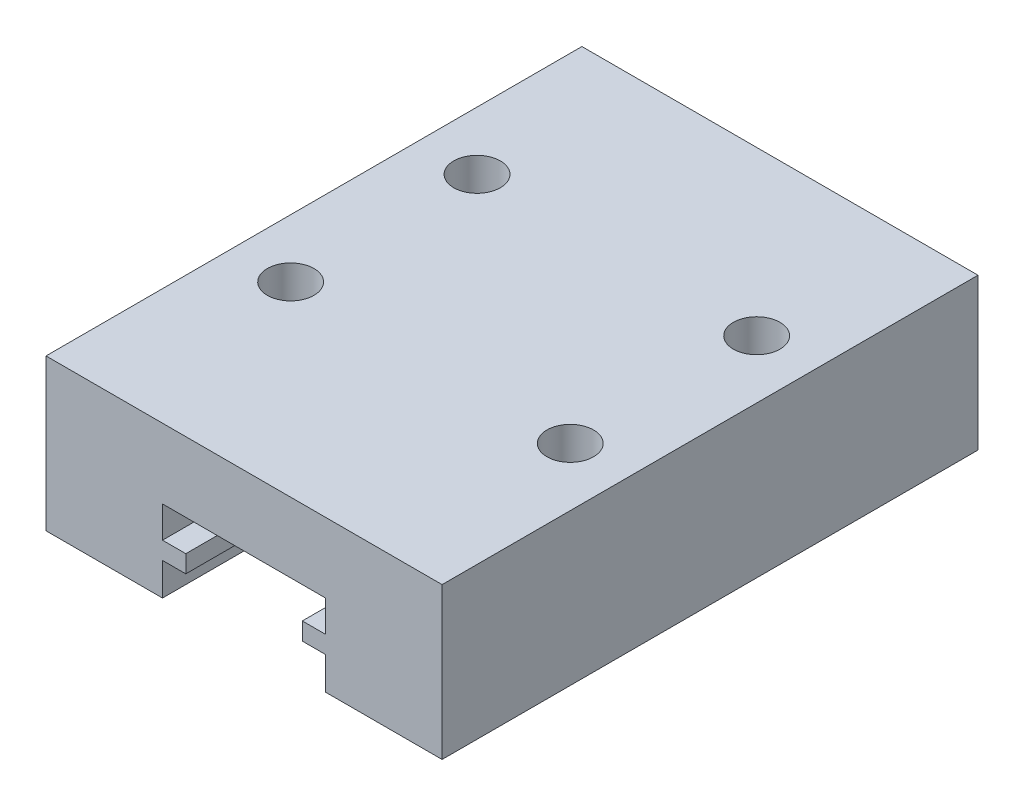
ISO-10303-21;
HEADER;
FILE_DESCRIPTION(('STEP AP214'),'2;1');
FILE_NAME('part.step','',(''),(''),'','','');
FILE_SCHEMA(('AUTOMOTIVE_DESIGN { 1 0 10303 214 1 1 1 1 }'));
ENDSEC;
DATA;
#1=APPLICATION_CONTEXT('core data for automotive mechanical design processes');
#2=APPLICATION_PROTOCOL_DEFINITION('international standard','automotive_design',2000,#1);
#3=PRODUCT_CONTEXT('',#1,'mechanical');
#4=PRODUCT('Part','Part','',(#3));
#5=PRODUCT_RELATED_PRODUCT_CATEGORY('part','',(#4));
#6=PRODUCT_DEFINITION_FORMATION('','',#4);
#7=PRODUCT_DEFINITION_CONTEXT('part definition',#1,'design');
#8=PRODUCT_DEFINITION('design','',#6,#7);
#9=PRODUCT_DEFINITION_SHAPE('','',#8);
#10=(LENGTH_UNIT() NAMED_UNIT(*) SI_UNIT(.MILLI.,.METRE.));
#11=(NAMED_UNIT(*) PLANE_ANGLE_UNIT() SI_UNIT($,.RADIAN.));
#12=(NAMED_UNIT(*) SI_UNIT($,.STERADIAN.) SOLID_ANGLE_UNIT());
#13=UNCERTAINTY_MEASURE_WITH_UNIT(LENGTH_MEASURE(1.E-05),#10,'distance_accuracy_value','');
#14=(GEOMETRIC_REPRESENTATION_CONTEXT(3) GLOBAL_UNCERTAINTY_ASSIGNED_CONTEXT((#13)) GLOBAL_UNIT_ASSIGNED_CONTEXT((#10,
#11,#12)) REPRESENTATION_CONTEXT('',''));
#15=CARTESIAN_POINT('',(0.,0.,0.));
#16=DIRECTION('',(0.,0.,1.));
#17=DIRECTION('',(1.,0.,0.));
#18=AXIS2_PLACEMENT_3D('',#15,#16,#17);
#19=CARTESIAN_POINT('',(0.,-3.25,23.));
#20=DIRECTION('',(0.,1.,0.));
#21=DIRECTION('',(0.,0.,1.));
#22=AXIS2_PLACEMENT_3D('',#19,#20,#21);
#23=PLANE('',#22);
#24=DIRECTION('',(1.,0.,0.));
#25=VECTOR('',#24,1.);
#26=CARTESIAN_POINT('',(0.,-3.25,0.));
#27=LINE('',#26,#25);
#28=CARTESIAN_POINT('',(-8.5,-3.25,0.));
#29=VERTEX_POINT('',#28);
#30=CARTESIAN_POINT('',(-3.5,-3.25,0.));
#31=VERTEX_POINT('',#30);
#32=EDGE_CURVE('E180',#29,#31,#27,.T.);
#33=ORIENTED_EDGE('',*,*,#32,.T.);
#34=DIRECTION('',(0.,0.,-1.));
#35=VECTOR('',#34,1.);
#36=CARTESIAN_POINT('',(-3.5,-3.25,23.));
#37=LINE('',#36,#35);
#38=CARTESIAN_POINT('',(-3.5,-3.25,23.));
#39=VERTEX_POINT('',#38);
#40=EDGE_CURVE('E11',#39,#31,#37,.T.);
#41=ORIENTED_EDGE('',*,*,#40,.F.);
#42=DIRECTION('',(1.,0.,0.));
#43=VECTOR('',#42,1.);
#44=CARTESIAN_POINT('',(0.,-3.25,23.));
#45=LINE('',#44,#43);
#46=CARTESIAN_POINT('',(-8.5,-3.25,23.));
#47=VERTEX_POINT('',#46);
#48=EDGE_CURVE('E218',#47,#39,#45,.T.);
#49=ORIENTED_EDGE('',*,*,#48,.F.);
#50=DIRECTION('',(0.,0.,-1.));
#51=VECTOR('',#50,1.);
#52=CARTESIAN_POINT('',(-8.5,-3.25,23.));
#53=LINE('',#52,#51);
#54=EDGE_CURVE('E176',#47,#29,#53,.T.);
#55=ORIENTED_EDGE('',*,*,#54,.T.);
#56=EDGE_LOOP('',(#33,#41,#49,#55));
#57=FACE_BOUND('',#56,.T.);
#58=ADVANCED_FACE('F36',(#57),#23,.F.);
#59=CARTESIAN_POINT('',(-3.5,0.,23.));
#60=DIRECTION('',(-1.,0.,0.));
#61=DIRECTION('',(0.,-1.,0.));
#62=AXIS2_PLACEMENT_3D('',#59,#60,#61);
#63=PLANE('',#62);
#64=DIRECTION('',(0.,1.,0.));
#65=VECTOR('',#64,1.);
#66=CARTESIAN_POINT('',(-3.5,0.,0.));
#67=LINE('',#66,#65);
#68=CARTESIAN_POINT('',(-3.5,-1.85,0.));
#69=VERTEX_POINT('',#68);
#70=EDGE_CURVE('E183',#31,#69,#67,.T.);
#71=ORIENTED_EDGE('',*,*,#70,.T.);
#72=DIRECTION('',(0.,0.,-1.));
#73=VECTOR('',#72,1.);
#74=CARTESIAN_POINT('',(-3.5,-1.85,23.));
#75=LINE('',#74,#73);
#76=CARTESIAN_POINT('',(-3.5,-1.85,23.));
#77=VERTEX_POINT('',#76);
#78=EDGE_CURVE('E45',#77,#69,#75,.T.);
#79=ORIENTED_EDGE('',*,*,#78,.F.);
#80=DIRECTION('',(0.,1.,0.));
#81=VECTOR('',#80,1.);
#82=CARTESIAN_POINT('',(-3.5,0.,23.));
#83=LINE('',#82,#81);
#84=EDGE_CURVE('E116',#39,#77,#83,.T.);
#85=ORIENTED_EDGE('',*,*,#84,.F.);
#86=ORIENTED_EDGE('',*,*,#40,.T.);
#87=EDGE_LOOP('',(#71,#79,#85,#86));
#88=FACE_BOUND('',#87,.T.);
#89=ADVANCED_FACE('F38',(#88),#63,.F.);
#90=CARTESIAN_POINT('',(0.,-1.85,23.));
#91=DIRECTION('',(0.,1.,0.));
#92=DIRECTION('',(-1.,0.,0.));
#93=AXIS2_PLACEMENT_3D('',#90,#91,#92);
#94=PLANE('',#93);
#95=DIRECTION('',(1.,0.,0.));
#96=VECTOR('',#95,1.);
#97=CARTESIAN_POINT('',(0.,-1.85,0.));
#98=LINE('',#97,#96);
#99=CARTESIAN_POINT('',(-2.5,-1.85,0.));
#100=VERTEX_POINT('',#99);
#101=EDGE_CURVE('E187',#69,#100,#98,.T.);
#102=ORIENTED_EDGE('',*,*,#101,.T.);
#103=DIRECTION('',(0.,0.,-1.));
#104=VECTOR('',#103,1.);
#105=CARTESIAN_POINT('',(-2.5,-1.85,23.));
#106=LINE('',#105,#104);
#107=CARTESIAN_POINT('',(-2.5,-1.85,23.));
#108=VERTEX_POINT('',#107);
#109=EDGE_CURVE('E242',#108,#100,#106,.T.);
#110=ORIENTED_EDGE('',*,*,#109,.F.);
#111=DIRECTION('',(1.,0.,0.));
#112=VECTOR('',#111,1.);
#113=CARTESIAN_POINT('',(0.,-1.85,23.));
#114=LINE('',#113,#112);
#115=EDGE_CURVE('E250',#77,#108,#114,.T.);
#116=ORIENTED_EDGE('',*,*,#115,.F.);
#117=ORIENTED_EDGE('',*,*,#78,.T.);
#118=EDGE_LOOP('',(#102,#110,#116,#117));
#119=FACE_BOUND('',#118,.T.);
#120=ADVANCED_FACE('F248',(#119),#94,.F.);
#121=CARTESIAN_POINT('',(-2.5,0.,23.));
#122=DIRECTION('',(-1.,0.,0.));
#123=DIRECTION('',(0.,0.,1.));
#124=AXIS2_PLACEMENT_3D('',#121,#122,#123);
#125=PLANE('',#124);
#126=DIRECTION('',(0.,1.,0.));
#127=VECTOR('',#126,1.);
#128=CARTESIAN_POINT('',(-2.5,0.,0.));
#129=LINE('',#128,#127);
#130=CARTESIAN_POINT('',(-2.5,-1.1,0.));
#131=VERTEX_POINT('',#130);
#132=EDGE_CURVE('E189',#100,#131,#129,.T.);
#133=ORIENTED_EDGE('',*,*,#132,.T.);
#134=DIRECTION('',(0.,0.,-1.));
#135=VECTOR('',#134,1.);
#136=CARTESIAN_POINT('',(-2.5,-1.1,23.));
#137=LINE('',#136,#135);
#138=CARTESIAN_POINT('',(-2.5,-1.1,23.));
#139=VERTEX_POINT('',#138);
#140=EDGE_CURVE('E239',#139,#131,#137,.T.);
#141=ORIENTED_EDGE('',*,*,#140,.F.);
#142=DIRECTION('',(0.,1.,0.));
#143=VECTOR('',#142,1.);
#144=CARTESIAN_POINT('',(-2.5,0.,23.));
#145=LINE('',#144,#143);
#146=EDGE_CURVE('E268',#108,#139,#145,.T.);
#147=ORIENTED_EDGE('',*,*,#146,.F.);
#148=ORIENTED_EDGE('',*,*,#109,.T.);
#149=EDGE_LOOP('',(#133,#141,#147,#148));
#150=FACE_BOUND('',#149,.T.);
#151=ADVANCED_FACE('F259',(#150),#125,.F.);
#152=CARTESIAN_POINT('',(0.,-1.1,23.));
#153=DIRECTION('',(0.,-1.,0.));
#154=DIRECTION('',(0.,0.,-1.));
#155=AXIS2_PLACEMENT_3D('',#152,#153,#154);
#156=PLANE('',#155);
#157=DIRECTION('',(-1.,0.,0.));
#158=VECTOR('',#157,1.);
#159=CARTESIAN_POINT('',(0.,-1.1,0.));
#160=LINE('',#159,#158);
#161=CARTESIAN_POINT('',(-3.5,-1.1,0.));
#162=VERTEX_POINT('',#161);
#163=EDGE_CURVE('E191',#131,#162,#160,.T.);
#164=ORIENTED_EDGE('',*,*,#163,.T.);
#165=DIRECTION('',(0.,0.,-1.));
#166=VECTOR('',#165,1.);
#167=CARTESIAN_POINT('',(-3.5,-1.1,23.));
#168=LINE('',#167,#166);
#169=CARTESIAN_POINT('',(-3.5,-1.1,23.));
#170=VERTEX_POINT('',#169);
#171=EDGE_CURVE('E236',#170,#162,#168,.T.);
#172=ORIENTED_EDGE('',*,*,#171,.F.);
#173=DIRECTION('',(-1.,0.,0.));
#174=VECTOR('',#173,1.);
#175=CARTESIAN_POINT('',(0.,-1.1,23.));
#176=LINE('',#175,#174);
#177=EDGE_CURVE('E265',#139,#170,#176,.T.);
#178=ORIENTED_EDGE('',*,*,#177,.F.);
#179=ORIENTED_EDGE('',*,*,#140,.T.);
#180=EDGE_LOOP('',(#164,#172,#178,#179));
#181=FACE_BOUND('',#180,.T.);
#182=ADVANCED_FACE('F263',(#181),#156,.F.);
#183=CARTESIAN_POINT('',(-3.5,0.,23.));
#184=DIRECTION('',(-1.,0.,0.));
#185=DIRECTION('',(0.,0.,1.));
#186=AXIS2_PLACEMENT_3D('',#183,#184,#185);
#187=PLANE('',#186);
#188=DIRECTION('',(0.,1.,0.));
#189=VECTOR('',#188,1.);
#190=CARTESIAN_POINT('',(-3.5,0.,0.));
#191=LINE('',#190,#189);
#192=CARTESIAN_POINT('',(-3.5,0.25,0.));
#193=VERTEX_POINT('',#192);
#194=EDGE_CURVE('E193',#162,#193,#191,.T.);
#195=ORIENTED_EDGE('',*,*,#194,.T.);
#196=DIRECTION('',(0.,0.,-1.));
#197=VECTOR('',#196,1.);
#198=CARTESIAN_POINT('',(-3.5,0.25,23.));
#199=LINE('',#198,#197);
#200=CARTESIAN_POINT('',(-3.5,0.25,23.));
#201=VERTEX_POINT('',#200);
#202=EDGE_CURVE('E234',#201,#193,#199,.T.);
#203=ORIENTED_EDGE('',*,*,#202,.F.);
#204=DIRECTION('',(0.,1.,0.));
#205=VECTOR('',#204,1.);
#206=CARTESIAN_POINT('',(-3.5,0.,23.));
#207=LINE('',#206,#205);
#208=EDGE_CURVE('E267',#170,#201,#207,.T.);
#209=ORIENTED_EDGE('',*,*,#208,.F.);
#210=ORIENTED_EDGE('',*,*,#171,.T.);
#211=EDGE_LOOP('',(#195,#203,#209,#210));
#212=FACE_BOUND('',#211,.T.);
#213=ADVANCED_FACE('F340',(#212),#187,.F.);
#214=CARTESIAN_POINT('',(0.,0.25,23.));
#215=DIRECTION('',(0.,-1.,0.));
#216=DIRECTION('',(0.,0.,-1.));
#217=AXIS2_PLACEMENT_3D('',#214,#215,#216);
#218=PLANE('',#217);
#219=DIRECTION('',(-1.,0.,0.));
#220=VECTOR('',#219,1.);
#221=CARTESIAN_POINT('',(0.,0.25,0.));
#222=LINE('',#221,#220);
#223=CARTESIAN_POINT('',(3.5,0.25,0.));
#224=VERTEX_POINT('',#223);
#225=EDGE_CURVE('E196',#224,#193,#222,.T.);
#226=ORIENTED_EDGE('',*,*,#225,.F.);
#227=DIRECTION('',(0.,0.,-1.));
#228=VECTOR('',#227,1.);
#229=CARTESIAN_POINT('',(3.5,0.25,23.));
#230=LINE('',#229,#228);
#231=CARTESIAN_POINT('',(3.5,0.25,23.));
#232=VERTEX_POINT('',#231);
#233=EDGE_CURVE('E232',#232,#224,#230,.T.);
#234=ORIENTED_EDGE('',*,*,#233,.F.);
#235=DIRECTION('',(-1.,0.,0.));
#236=VECTOR('',#235,1.);
#237=CARTESIAN_POINT('',(0.,0.25,23.));
#238=LINE('',#237,#236);
#239=EDGE_CURVE('E270',#232,#201,#238,.T.);
#240=ORIENTED_EDGE('',*,*,#239,.T.);
#241=ORIENTED_EDGE('',*,*,#202,.T.);
#242=EDGE_LOOP('',(#226,#234,#240,#241));
#243=FACE_BOUND('',#242,.T.);
#244=ADVANCED_FACE('F336',(#243),#218,.T.);
#245=CARTESIAN_POINT('',(3.5,0.,23.));
#246=DIRECTION('',(-1.,0.,0.));
#247=DIRECTION('',(0.,0.,1.));
#248=AXIS2_PLACEMENT_3D('',#245,#246,#247);
#249=PLANE('',#248);
#250=DIRECTION('',(0.,1.,0.));
#251=VECTOR('',#250,1.);
#252=CARTESIAN_POINT('',(3.5,0.,0.));
#253=LINE('',#252,#251);
#254=CARTESIAN_POINT('',(3.5,-1.1,0.));
#255=VERTEX_POINT('',#254);
#256=EDGE_CURVE('E199',#255,#224,#253,.T.);
#257=ORIENTED_EDGE('',*,*,#256,.F.);
#258=DIRECTION('',(0.,0.,-1.));
#259=VECTOR('',#258,1.);
#260=CARTESIAN_POINT('',(3.5,-1.1,23.));
#261=LINE('',#260,#259);
#262=CARTESIAN_POINT('',(3.5,-1.1,23.));
#263=VERTEX_POINT('',#262);
#264=EDGE_CURVE('E230',#263,#255,#261,.T.);
#265=ORIENTED_EDGE('',*,*,#264,.F.);
#266=DIRECTION('',(0.,1.,0.));
#267=VECTOR('',#266,1.);
#268=CARTESIAN_POINT('',(3.5,0.,23.));
#269=LINE('',#268,#267);
#270=EDGE_CURVE('E277',#263,#232,#269,.T.);
#271=ORIENTED_EDGE('',*,*,#270,.T.);
#272=ORIENTED_EDGE('',*,*,#233,.T.);
#273=EDGE_LOOP('',(#257,#265,#271,#272));
#274=FACE_BOUND('',#273,.T.);
#275=ADVANCED_FACE('F333',(#274),#249,.T.);
#276=CARTESIAN_POINT('',(0.,-1.1,23.));
#277=DIRECTION('',(0.,1.,0.));
#278=DIRECTION('',(0.,0.,1.));
#279=AXIS2_PLACEMENT_3D('',#276,#277,#278);
#280=PLANE('',#279);
#281=DIRECTION('',(1.,0.,0.));
#282=VECTOR('',#281,1.);
#283=CARTESIAN_POINT('',(0.,-1.1,0.));
#284=LINE('',#283,#282);
#285=CARTESIAN_POINT('',(2.5,-1.1,0.));
#286=VERTEX_POINT('',#285);
#287=EDGE_CURVE('E202',#286,#255,#284,.T.);
#288=ORIENTED_EDGE('',*,*,#287,.F.);
#289=DIRECTION('',(0.,0.,-1.));
#290=VECTOR('',#289,1.);
#291=CARTESIAN_POINT('',(2.5,-1.1,23.));
#292=LINE('',#291,#290);
#293=CARTESIAN_POINT('',(2.5,-1.1,23.));
#294=VERTEX_POINT('',#293);
#295=EDGE_CURVE('E228',#294,#286,#292,.T.);
#296=ORIENTED_EDGE('',*,*,#295,.F.);
#297=DIRECTION('',(1.,0.,0.));
#298=VECTOR('',#297,1.);
#299=CARTESIAN_POINT('',(0.,-1.1,23.));
#300=LINE('',#299,#298);
#301=EDGE_CURVE('E280',#294,#263,#300,.T.);
#302=ORIENTED_EDGE('',*,*,#301,.T.);
#303=ORIENTED_EDGE('',*,*,#264,.T.);
#304=EDGE_LOOP('',(#288,#296,#302,#303));
#305=FACE_BOUND('',#304,.T.);
#306=ADVANCED_FACE('F329',(#305),#280,.T.);
#307=CARTESIAN_POINT('',(2.5,0.,23.));
#308=DIRECTION('',(-1.,0.,0.));
#309=DIRECTION('',(0.,0.,1.));
#310=AXIS2_PLACEMENT_3D('',#307,#308,#309);
#311=PLANE('',#310);
#312=DIRECTION('',(0.,1.,0.));
#313=VECTOR('',#312,1.);
#314=CARTESIAN_POINT('',(2.5,0.,0.));
#315=LINE('',#314,#313);
#316=CARTESIAN_POINT('',(2.5,-1.85,0.));
#317=VERTEX_POINT('',#316);
#318=EDGE_CURVE('E205',#317,#286,#315,.T.);
#319=ORIENTED_EDGE('',*,*,#318,.F.);
#320=DIRECTION('',(0.,0.,-1.));
#321=VECTOR('',#320,1.);
#322=CARTESIAN_POINT('',(2.5,-1.85,23.));
#323=LINE('',#322,#321);
#324=CARTESIAN_POINT('',(2.5,-1.85,23.));
#325=VERTEX_POINT('',#324);
#326=EDGE_CURVE('E226',#325,#317,#323,.T.);
#327=ORIENTED_EDGE('',*,*,#326,.F.);
#328=DIRECTION('',(0.,1.,0.));
#329=VECTOR('',#328,1.);
#330=CARTESIAN_POINT('',(2.5,0.,23.));
#331=LINE('',#330,#329);
#332=EDGE_CURVE('E283',#325,#294,#331,.T.);
#333=ORIENTED_EDGE('',*,*,#332,.T.);
#334=ORIENTED_EDGE('',*,*,#295,.T.);
#335=EDGE_LOOP('',(#319,#327,#333,#334));
#336=FACE_BOUND('',#335,.T.);
#337=ADVANCED_FACE('F325',(#336),#311,.T.);
#338=CARTESIAN_POINT('',(0.,-1.85,23.));
#339=DIRECTION('',(0.,-1.,0.));
#340=DIRECTION('',(1.,0.,0.));
#341=AXIS2_PLACEMENT_3D('',#338,#339,#340);
#342=PLANE('',#341);
#343=DIRECTION('',(-1.,0.,0.));
#344=VECTOR('',#343,1.);
#345=CARTESIAN_POINT('',(0.,-1.85,0.));
#346=LINE('',#345,#344);
#347=CARTESIAN_POINT('',(3.5,-1.85,0.));
#348=VERTEX_POINT('',#347);
#349=EDGE_CURVE('E208',#348,#317,#346,.T.);
#350=ORIENTED_EDGE('',*,*,#349,.F.);
#351=DIRECTION('',(0.,0.,-1.));
#352=VECTOR('',#351,1.);
#353=CARTESIAN_POINT('',(3.5,-1.85,23.));
#354=LINE('',#353,#352);
#355=CARTESIAN_POINT('',(3.5,-1.85,23.));
#356=VERTEX_POINT('',#355);
#357=EDGE_CURVE('E224',#356,#348,#354,.T.);
#358=ORIENTED_EDGE('',*,*,#357,.F.);
#359=DIRECTION('',(-1.,0.,0.));
#360=VECTOR('',#359,1.);
#361=CARTESIAN_POINT('',(0.,-1.85,23.));
#362=LINE('',#361,#360);
#363=EDGE_CURVE('E286',#356,#325,#362,.T.);
#364=ORIENTED_EDGE('',*,*,#363,.T.);
#365=ORIENTED_EDGE('',*,*,#326,.T.);
#366=EDGE_LOOP('',(#350,#358,#364,#365));
#367=FACE_BOUND('',#366,.T.);
#368=ADVANCED_FACE('F315',(#367),#342,.T.);
#369=CARTESIAN_POINT('',(3.5,0.,23.));
#370=DIRECTION('',(-1.,0.,0.));
#371=DIRECTION('',(0.,-1.,0.));
#372=AXIS2_PLACEMENT_3D('',#369,#370,#371);
#373=PLANE('',#372);
#374=DIRECTION('',(0.,1.,0.));
#375=VECTOR('',#374,1.);
#376=CARTESIAN_POINT('',(3.5,0.,0.));
#377=LINE('',#376,#375);
#378=CARTESIAN_POINT('',(3.5,-3.25,0.));
#379=VERTEX_POINT('',#378);
#380=EDGE_CURVE('E211',#379,#348,#377,.T.);
#381=ORIENTED_EDGE('',*,*,#380,.F.);
#382=DIRECTION('',(0.,0.,-1.));
#383=VECTOR('',#382,1.);
#384=CARTESIAN_POINT('',(3.5,-3.25,23.));
#385=LINE('',#384,#383);
#386=CARTESIAN_POINT('',(3.5,-3.25,23.));
#387=VERTEX_POINT('',#386);
#388=EDGE_CURVE('E222',#387,#379,#385,.T.);
#389=ORIENTED_EDGE('',*,*,#388,.F.);
#390=DIRECTION('',(0.,1.,0.));
#391=VECTOR('',#390,1.);
#392=CARTESIAN_POINT('',(3.5,0.,23.));
#393=LINE('',#392,#391);
#394=EDGE_CURVE('E288',#387,#356,#393,.T.);
#395=ORIENTED_EDGE('',*,*,#394,.T.);
#396=ORIENTED_EDGE('',*,*,#357,.T.);
#397=EDGE_LOOP('',(#381,#389,#395,#396));
#398=FACE_BOUND('',#397,.T.);
#399=ADVANCED_FACE('F309',(#398),#373,.T.);
#400=CARTESIAN_POINT('',(8.5,-3.25,0.));
#401=VERTEX_POINT('',#400);
#402=EDGE_CURVE('E185',#379,#401,#27,.T.);
#403=ORIENTED_EDGE('',*,*,#402,.T.);
#404=DIRECTION('',(0.,0.,-1.));
#405=VECTOR('',#404,1.);
#406=CARTESIAN_POINT('',(8.5,-3.25,23.));
#407=LINE('',#406,#405);
#408=CARTESIAN_POINT('',(8.5,-3.25,23.));
#409=VERTEX_POINT('',#408);
#410=EDGE_CURVE('E165',#409,#401,#407,.T.);
#411=ORIENTED_EDGE('',*,*,#410,.F.);
#412=EDGE_CURVE('E171',#387,#409,#45,.T.);
#413=ORIENTED_EDGE('',*,*,#412,.F.);
#414=ORIENTED_EDGE('',*,*,#388,.T.);
#415=EDGE_LOOP('',(#403,#411,#413,#414));
#416=FACE_BOUND('',#415,.T.);
#417=ADVANCED_FACE('F303',(#416),#23,.F.);
#418=CARTESIAN_POINT('',(8.5,0.,23.));
#419=DIRECTION('',(1.,0.,0.));
#420=DIRECTION('',(0.,0.,-1.));
#421=AXIS2_PLACEMENT_3D('',#418,#419,#420);
#422=PLANE('',#421);
#423=DIRECTION('',(0.,-1.,0.));
#424=VECTOR('',#423,1.);
#425=CARTESIAN_POINT('',(8.5,0.,0.));
#426=LINE('',#425,#424);
#427=CARTESIAN_POINT('',(8.5,3.25,0.));
#428=VERTEX_POINT('',#427);
#429=EDGE_CURVE('E160',#428,#401,#426,.T.);
#430=ORIENTED_EDGE('',*,*,#429,.F.);
#431=DIRECTION('',(0.,0.,-1.));
#432=VECTOR('',#431,1.);
#433=CARTESIAN_POINT('',(8.5,3.25,23.));
#434=LINE('',#433,#432);
#435=CARTESIAN_POINT('',(8.5,3.25,23.));
#436=VERTEX_POINT('',#435);
#437=EDGE_CURVE('E155',#436,#428,#434,.T.);
#438=ORIENTED_EDGE('',*,*,#437,.F.);
#439=DIRECTION('',(0.,-1.,0.));
#440=VECTOR('',#439,1.);
#441=CARTESIAN_POINT('',(8.5,0.,23.));
#442=LINE('',#441,#440);
#443=EDGE_CURVE('E158',#436,#409,#442,.T.);
#444=ORIENTED_EDGE('',*,*,#443,.T.);
#445=ORIENTED_EDGE('',*,*,#410,.T.);
#446=EDGE_LOOP('',(#430,#438,#444,#445));
#447=FACE_BOUND('',#446,.T.);
#448=ADVANCED_FACE('F157',(#447),#422,.T.);
#449=CARTESIAN_POINT('',(0.,3.25,23.));
#450=DIRECTION('',(0.,1.,0.));
#451=DIRECTION('',(0.,0.,1.));
#452=AXIS2_PLACEMENT_3D('',#449,#450,#451);
#453=PLANE('',#452);
#454=CARTESIAN_POINT('',(6.,3.25,7.));
#455=DIRECTION('',(0.,1.,0.));
#456=DIRECTION('',(0.,0.,1.));
#457=AXIS2_PLACEMENT_3D('',#454,#455,#456);
#458=CIRCLE('',#457,1.);
#459=CARTESIAN_POINT('',(6.,3.25,8.));
#460=VERTEX_POINT('',#459);
#461=EDGE_CURVE('E539',#460,#460,#458,.T.);
#462=ORIENTED_EDGE('',*,*,#461,.F.);
#463=EDGE_LOOP('',(#462));
#464=FACE_BOUND('',#463,.T.);
#465=CARTESIAN_POINT('',(-5.99999999999992,3.25,15.));
#466=DIRECTION('',(0.,1.,0.));
#467=DIRECTION('',(0.,0.,1.));
#468=AXIS2_PLACEMENT_3D('',#465,#466,#467);
#469=CIRCLE('',#468,0.999999999999999);
#470=CARTESIAN_POINT('',(-5.99999999999992,3.25,16.));
#471=VERTEX_POINT('',#470);
#472=EDGE_CURVE('E551',#471,#471,#469,.T.);
#473=ORIENTED_EDGE('',*,*,#472,.F.);
#474=EDGE_LOOP('',(#473));
#475=FACE_BOUND('',#474,.T.);
#476=CARTESIAN_POINT('',(6.00000000000008,3.25,15.));
#477=DIRECTION('',(0.,1.,0.));
#478=DIRECTION('',(0.,0.,1.));
#479=AXIS2_PLACEMENT_3D('',#476,#477,#478);
#480=CIRCLE('',#479,0.999999999999999);
#481=CARTESIAN_POINT('',(6.00000000000008,3.25,16.));
#482=VERTEX_POINT('',#481);
#483=EDGE_CURVE('E546',#482,#482,#480,.T.);
#484=ORIENTED_EDGE('',*,*,#483,.F.);
#485=EDGE_LOOP('',(#484));
#486=FACE_BOUND('',#485,.T.);
#487=CARTESIAN_POINT('',(-6.,3.25,7.));
#488=DIRECTION('',(0.,1.,0.));
#489=DIRECTION('',(0.,0.,1.));
#490=AXIS2_PLACEMENT_3D('',#487,#488,#489);
#491=CIRCLE('',#490,1.);
#492=CARTESIAN_POINT('',(-6.,3.25,8.));
#493=VERTEX_POINT('',#492);
#494=EDGE_CURVE('E538',#493,#493,#491,.T.);
#495=ORIENTED_EDGE('',*,*,#494,.F.);
#496=EDGE_LOOP('',(#495));
#497=FACE_BOUND('',#496,.T.);
#498=DIRECTION('',(1.,0.,0.));
#499=VECTOR('',#498,1.);
#500=CARTESIAN_POINT('',(0.,3.25,0.));
#501=LINE('',#500,#499);
#502=CARTESIAN_POINT('',(-8.5,3.25,0.));
#503=VERTEX_POINT('',#502);
#504=EDGE_CURVE('E215',#503,#428,#501,.T.);
#505=ORIENTED_EDGE('',*,*,#504,.F.);
#506=DIRECTION('',(0.,0.,-1.));
#507=VECTOR('',#506,1.);
#508=CARTESIAN_POINT('',(-8.5,3.25,23.));
#509=LINE('',#508,#507);
#510=CARTESIAN_POINT('',(-8.5,3.25,23.));
#511=VERTEX_POINT('',#510);
#512=EDGE_CURVE('E105',#511,#503,#509,.T.);
#513=ORIENTED_EDGE('',*,*,#512,.F.);
#514=DIRECTION('',(1.,0.,0.));
#515=VECTOR('',#514,1.);
#516=CARTESIAN_POINT('',(0.,3.25,23.));
#517=LINE('',#516,#515);
#518=EDGE_CURVE('E168',#511,#436,#517,.T.);
#519=ORIENTED_EDGE('',*,*,#518,.T.);
#520=ORIENTED_EDGE('',*,*,#437,.T.);
#521=EDGE_LOOP('',(#505,#513,#519,#520));
#522=FACE_BOUND('',#521,.T.);
#523=ADVANCED_FACE('F174',(#464,#475,#486,#497,#522),#453,.T.);
#524=CARTESIAN_POINT('',(-8.5,0.,23.));
#525=DIRECTION('',(1.,0.,0.));
#526=DIRECTION('',(0.,0.,-1.));
#527=AXIS2_PLACEMENT_3D('',#524,#525,#526);
#528=PLANE('',#527);
#529=DIRECTION('',(0.,-1.,0.));
#530=VECTOR('',#529,1.);
#531=CARTESIAN_POINT('',(-8.5,0.,0.));
#532=LINE('',#531,#530);
#533=EDGE_CURVE('E108',#503,#29,#532,.T.);
#534=ORIENTED_EDGE('',*,*,#533,.T.);
#535=ORIENTED_EDGE('',*,*,#54,.F.);
#536=DIRECTION('',(0.,-1.,0.));
#537=VECTOR('',#536,1.);
#538=CARTESIAN_POINT('',(-8.5,0.,23.));
#539=LINE('',#538,#537);
#540=EDGE_CURVE('E53',#511,#47,#539,.T.);
#541=ORIENTED_EDGE('',*,*,#540,.F.);
#542=ORIENTED_EDGE('',*,*,#512,.T.);
#543=EDGE_LOOP('',(#534,#535,#541,#542));
#544=FACE_BOUND('',#543,.T.);
#545=ADVANCED_FACE('F424',(#544),#528,.F.);
#546=CARTESIAN_POINT('',(0.,0.,23.));
#547=DIRECTION('',(0.,0.,1.));
#548=DIRECTION('',(1.,0.,0.));
#549=AXIS2_PLACEMENT_3D('',#546,#547,#548);
#550=PLANE('',#549);
#551=ORIENTED_EDGE('',*,*,#48,.T.);
#552=ORIENTED_EDGE('',*,*,#84,.T.);
#553=ORIENTED_EDGE('',*,*,#115,.T.);
#554=ORIENTED_EDGE('',*,*,#146,.T.);
#555=ORIENTED_EDGE('',*,*,#177,.T.);
#556=ORIENTED_EDGE('',*,*,#208,.T.);
#557=ORIENTED_EDGE('',*,*,#239,.F.);
#558=ORIENTED_EDGE('',*,*,#270,.F.);
#559=ORIENTED_EDGE('',*,*,#301,.F.);
#560=ORIENTED_EDGE('',*,*,#332,.F.);
#561=ORIENTED_EDGE('',*,*,#363,.F.);
#562=ORIENTED_EDGE('',*,*,#394,.F.);
#563=ORIENTED_EDGE('',*,*,#412,.T.);
#564=ORIENTED_EDGE('',*,*,#443,.F.);
#565=ORIENTED_EDGE('',*,*,#518,.F.);
#566=ORIENTED_EDGE('',*,*,#540,.T.);
#567=EDGE_LOOP('',(#551,#552,#553,#554,#555,#556,#557,#558,#559,#560,#561,#562,#563,#564,#565,#566));
#568=FACE_BOUND('',#567,.T.);
#569=ADVANCED_FACE('F167',(#568),#550,.T.);
#570=CARTESIAN_POINT('',(0.,0.,0.));
#571=DIRECTION('',(0.,0.,1.));
#572=DIRECTION('',(1.,0.,0.));
#573=AXIS2_PLACEMENT_3D('',#570,#571,#572);
#574=PLANE('',#573);
#575=ORIENTED_EDGE('',*,*,#32,.F.);
#576=ORIENTED_EDGE('',*,*,#533,.F.);
#577=ORIENTED_EDGE('',*,*,#504,.T.);
#578=ORIENTED_EDGE('',*,*,#429,.T.);
#579=ORIENTED_EDGE('',*,*,#402,.F.);
#580=ORIENTED_EDGE('',*,*,#380,.T.);
#581=ORIENTED_EDGE('',*,*,#349,.T.);
#582=ORIENTED_EDGE('',*,*,#318,.T.);
#583=ORIENTED_EDGE('',*,*,#287,.T.);
#584=ORIENTED_EDGE('',*,*,#256,.T.);
#585=ORIENTED_EDGE('',*,*,#225,.T.);
#586=ORIENTED_EDGE('',*,*,#194,.F.);
#587=ORIENTED_EDGE('',*,*,#163,.F.);
#588=ORIENTED_EDGE('',*,*,#132,.F.);
#589=ORIENTED_EDGE('',*,*,#101,.F.);
#590=ORIENTED_EDGE('',*,*,#70,.F.);
#591=EDGE_LOOP('',(#575,#576,#577,#578,#579,#580,#581,#582,#583,#584,#585,#586,#587,#588,#589,#590));
#592=FACE_BOUND('',#591,.T.);
#593=ADVANCED_FACE('F254',(#592),#574,.F.);
#594=CARTESIAN_POINT('',(-6.,0.25,7.));
#595=DIRECTION('',(0.,1.,0.));
#596=DIRECTION('',(0.,0.,1.));
#597=AXIS2_PLACEMENT_3D('',#594,#595,#596);
#598=CYLINDRICAL_SURFACE('',#597,1.);
#599=CARTESIAN_POINT('',(-6.,0.25,7.));
#600=DIRECTION('',(0.,1.,0.));
#601=DIRECTION('',(0.,0.,1.));
#602=AXIS2_PLACEMENT_3D('',#599,#600,#601);
#603=CIRCLE('',#602,1.);
#604=CARTESIAN_POINT('',(-6.,0.25,8.));
#605=VERTEX_POINT('',#604);
#606=EDGE_CURVE('E184',#605,#605,#603,.T.);
#607=ORIENTED_EDGE('',*,*,#606,.F.);
#608=EDGE_LOOP('',(#607));
#609=FACE_BOUND('',#608,.T.);
#610=ORIENTED_EDGE('',*,*,#494,.T.);
#611=EDGE_LOOP('',(#610));
#612=FACE_BOUND('',#611,.T.);
#613=ADVANCED_FACE('F445',(#609,#612),#598,.F.);
#614=CARTESIAN_POINT('',(-6.,0.25,7.));
#615=DIRECTION('',(0.,1.,0.));
#616=DIRECTION('',(0.,0.,1.));
#617=AXIS2_PLACEMENT_3D('',#614,#615,#616);
#618=PLANE('',#617);
#619=ORIENTED_EDGE('',*,*,#606,.T.);
#620=EDGE_LOOP('',(#619));
#621=FACE_BOUND('',#620,.T.);
#622=ADVANCED_FACE('F461',(#621),#618,.T.);
#623=CARTESIAN_POINT('',(6.00000000000008,0.25,15.));
#624=DIRECTION('',(0.,1.,0.));
#625=DIRECTION('',(0.,0.,1.));
#626=AXIS2_PLACEMENT_3D('',#623,#624,#625);
#627=CYLINDRICAL_SURFACE('',#626,0.999999999999999);
#628=CARTESIAN_POINT('',(6.00000000000008,0.25,15.));
#629=DIRECTION('',(0.,1.,0.));
#630=DIRECTION('',(0.,0.,1.));
#631=AXIS2_PLACEMENT_3D('',#628,#629,#630);
#632=CIRCLE('',#631,0.999999999999999);
#633=CARTESIAN_POINT('',(6.00000000000008,0.25,16.));
#634=VERTEX_POINT('',#633);
#635=EDGE_CURVE('E554',#634,#634,#632,.T.);
#636=ORIENTED_EDGE('',*,*,#635,.F.);
#637=EDGE_LOOP('',(#636));
#638=FACE_BOUND('',#637,.T.);
#639=ORIENTED_EDGE('',*,*,#483,.T.);
#640=EDGE_LOOP('',(#639));
#641=FACE_BOUND('',#640,.T.);
#642=ADVANCED_FACE('F471',(#638,#641),#627,.F.);
#643=CARTESIAN_POINT('',(6.00000000000008,0.25,15.));
#644=DIRECTION('',(0.,1.,0.));
#645=DIRECTION('',(0.,0.,1.));
#646=AXIS2_PLACEMENT_3D('',#643,#644,#645);
#647=PLANE('',#646);
#648=ORIENTED_EDGE('',*,*,#635,.T.);
#649=EDGE_LOOP('',(#648));
#650=FACE_BOUND('',#649,.T.);
#651=ADVANCED_FACE('F481',(#650),#647,.T.);
#652=CARTESIAN_POINT('',(-5.99999999999992,0.25,15.));
#653=DIRECTION('',(0.,1.,0.));
#654=DIRECTION('',(0.,0.,1.));
#655=AXIS2_PLACEMENT_3D('',#652,#653,#654);
#656=CYLINDRICAL_SURFACE('',#655,0.999999999999999);
#657=CARTESIAN_POINT('',(-5.99999999999992,0.25,15.));
#658=DIRECTION('',(0.,1.,0.));
#659=DIRECTION('',(0.,0.,1.));
#660=AXIS2_PLACEMENT_3D('',#657,#658,#659);
#661=CIRCLE('',#660,0.999999999999999);
#662=CARTESIAN_POINT('',(-5.99999999999992,0.25,16.));
#663=VERTEX_POINT('',#662);
#664=EDGE_CURVE('E543',#663,#663,#661,.T.);
#665=ORIENTED_EDGE('',*,*,#664,.F.);
#666=EDGE_LOOP('',(#665));
#667=FACE_BOUND('',#666,.T.);
#668=ORIENTED_EDGE('',*,*,#472,.T.);
#669=EDGE_LOOP('',(#668));
#670=FACE_BOUND('',#669,.T.);
#671=ADVANCED_FACE('F491',(#667,#670),#656,.F.);
#672=CARTESIAN_POINT('',(-5.99999999999992,0.25,15.));
#673=DIRECTION('',(0.,1.,0.));
#674=DIRECTION('',(0.,0.,1.));
#675=AXIS2_PLACEMENT_3D('',#672,#673,#674);
#676=PLANE('',#675);
#677=ORIENTED_EDGE('',*,*,#664,.T.);
#678=EDGE_LOOP('',(#677));
#679=FACE_BOUND('',#678,.T.);
#680=ADVANCED_FACE('F501',(#679),#676,.T.);
#681=CARTESIAN_POINT('',(6.,0.25,7.));
#682=DIRECTION('',(0.,1.,0.));
#683=DIRECTION('',(0.,0.,1.));
#684=AXIS2_PLACEMENT_3D('',#681,#682,#683);
#685=CYLINDRICAL_SURFACE('',#684,1.);
#686=CARTESIAN_POINT('',(6.,0.25,7.));
#687=DIRECTION('',(0.,1.,0.));
#688=DIRECTION('',(0.,0.,1.));
#689=AXIS2_PLACEMENT_3D('',#686,#687,#688);
#690=CIRCLE('',#689,1.);
#691=CARTESIAN_POINT('',(6.,0.25,8.));
#692=VERTEX_POINT('',#691);
#693=EDGE_CURVE('E537',#692,#692,#690,.T.);
#694=ORIENTED_EDGE('',*,*,#693,.F.);
#695=EDGE_LOOP('',(#694));
#696=FACE_BOUND('',#695,.T.);
#697=ORIENTED_EDGE('',*,*,#461,.T.);
#698=EDGE_LOOP('',(#697));
#699=FACE_BOUND('',#698,.T.);
#700=ADVANCED_FACE('F511',(#696,#699),#685,.F.);
#701=CARTESIAN_POINT('',(6.,0.25,7.));
#702=DIRECTION('',(0.,1.,0.));
#703=DIRECTION('',(0.,0.,1.));
#704=AXIS2_PLACEMENT_3D('',#701,#702,#703);
#705=PLANE('',#704);
#706=ORIENTED_EDGE('',*,*,#693,.T.);
#707=EDGE_LOOP('',(#706));
#708=FACE_BOUND('',#707,.T.);
#709=ADVANCED_FACE('F521',(#708),#705,.T.);
#710=CLOSED_SHELL('',(#58,#89,#120,#151,#182,#213,#244,#275,#306,#337,#368,#399,#417,#448,#523,
#545,#569,#593,#613,#622,#642,#651,#671,#680,#700,#709));
#711=MANIFOLD_SOLID_BREP('B2',#710);
#712=ADVANCED_BREP_SHAPE_REPRESENTATION('',(#18,#711),#14);
#713=SHAPE_DEFINITION_REPRESENTATION(#9,#712);
ENDSEC;
END-ISO-10303-21;
